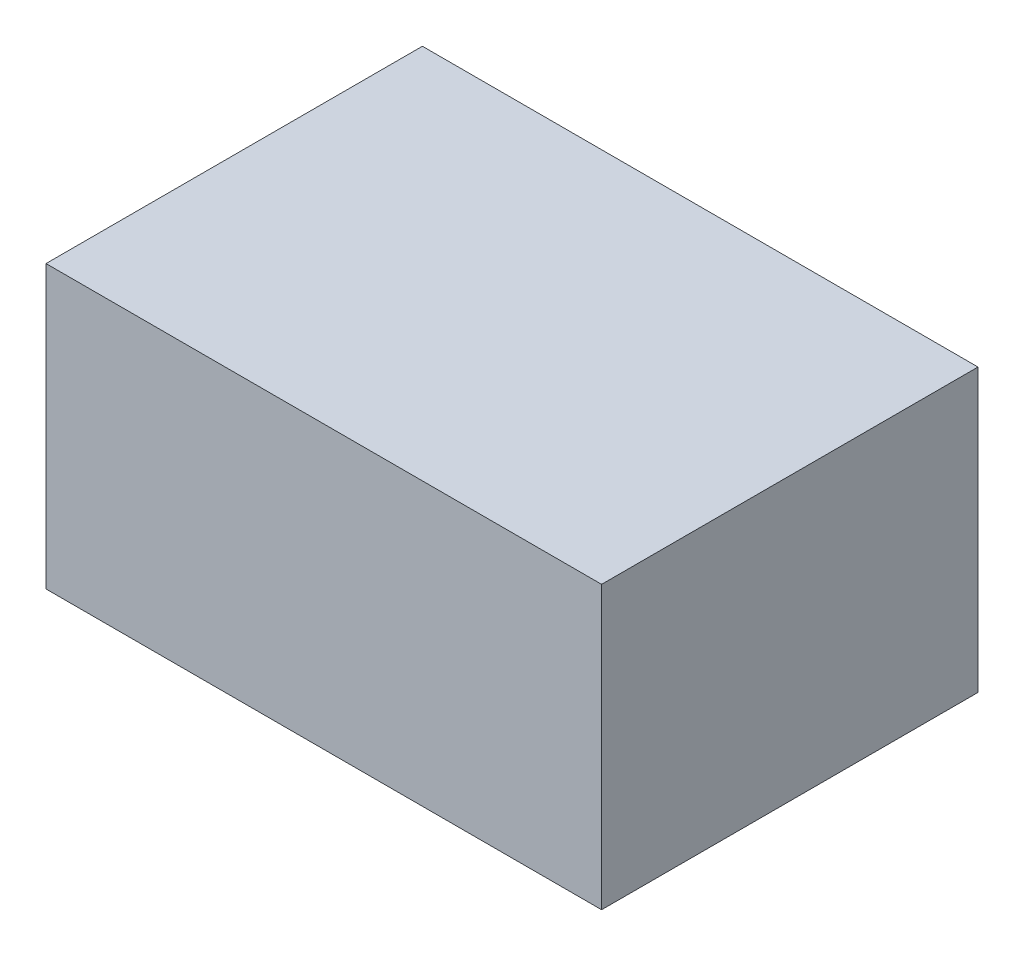
ISO-10303-21;
HEADER;
FILE_DESCRIPTION(('STEP AP214'),'2;1');
FILE_NAME('part.step','',(''),(''),'','','');
FILE_SCHEMA(('AUTOMOTIVE_DESIGN { 1 0 10303 214 1 1 1 1 }'));
ENDSEC;
DATA;
#1=APPLICATION_CONTEXT('core data for automotive mechanical design processes');
#2=APPLICATION_PROTOCOL_DEFINITION('international standard','automotive_design',2000,#1);
#3=PRODUCT_CONTEXT('',#1,'mechanical');
#4=PRODUCT('Part','Part','',(#3));
#5=PRODUCT_RELATED_PRODUCT_CATEGORY('part','',(#4));
#6=PRODUCT_DEFINITION_FORMATION('','',#4);
#7=PRODUCT_DEFINITION_CONTEXT('part definition',#1,'design');
#8=PRODUCT_DEFINITION('design','',#6,#7);
#9=PRODUCT_DEFINITION_SHAPE('','',#8);
#10=(LENGTH_UNIT() NAMED_UNIT(*) SI_UNIT(.MILLI.,.METRE.));
#11=(NAMED_UNIT(*) PLANE_ANGLE_UNIT() SI_UNIT($,.RADIAN.));
#12=(NAMED_UNIT(*) SI_UNIT($,.STERADIAN.) SOLID_ANGLE_UNIT());
#13=UNCERTAINTY_MEASURE_WITH_UNIT(LENGTH_MEASURE(1.E-05),#10,'distance_accuracy_value','');
#14=(GEOMETRIC_REPRESENTATION_CONTEXT(3) GLOBAL_UNCERTAINTY_ASSIGNED_CONTEXT((#13)) GLOBAL_UNIT_ASSIGNED_CONTEXT((#10,
#11,#12)) REPRESENTATION_CONTEXT('',''));
#15=CARTESIAN_POINT('',(0.,0.,0.));
#16=DIRECTION('',(0.,0.,1.));
#17=DIRECTION('',(1.,0.,0.));
#18=AXIS2_PLACEMENT_3D('',#15,#16,#17);
#19=CARTESIAN_POINT('',(39.4274796646799,20.,-26.7105473204105));
#20=DIRECTION('',(-1.,0.,0.));
#21=DIRECTION('',(0.,0.,1.));
#22=AXIS2_PLACEMENT_3D('',#19,#20,#21);
#23=PLANE('',#22);
#24=DIRECTION('',(0.,0.,-1.));
#25=VECTOR('',#24,1.);
#26=CARTESIAN_POINT('',(39.4274796646799,-20.,-26.7105473204105));
#27=LINE('',#26,#25);
#28=CARTESIAN_POINT('',(39.4274796646799,-20.,26.7105473204105));
#29=VERTEX_POINT('',#28);
#30=CARTESIAN_POINT('',(39.4274796646799,-20.,-26.7105473204105));
#31=VERTEX_POINT('',#30);
#32=EDGE_CURVE('E96',#29,#31,#27,.T.);
#33=ORIENTED_EDGE('',*,*,#32,.T.);
#34=DIRECTION('',(0.,-1.,0.));
#35=VECTOR('',#34,1.);
#36=CARTESIAN_POINT('',(39.4274796646799,20.,-26.7105473204105));
#37=LINE('',#36,#35);
#38=CARTESIAN_POINT('',(39.4274796646799,20.,-26.7105473204105));
#39=VERTEX_POINT('',#38);
#40=EDGE_CURVE('E11',#39,#31,#37,.T.);
#41=ORIENTED_EDGE('',*,*,#40,.F.);
#42=DIRECTION('',(0.,0.,-1.));
#43=VECTOR('',#42,1.);
#44=CARTESIAN_POINT('',(39.4274796646799,20.,-26.7105473204105));
#45=LINE('',#44,#43);
#46=CARTESIAN_POINT('',(39.4274796646799,20.,26.7105473204105));
#47=VERTEX_POINT('',#46);
#48=EDGE_CURVE('E84',#47,#39,#45,.T.);
#49=ORIENTED_EDGE('',*,*,#48,.F.);
#50=DIRECTION('',(0.,-1.,0.));
#51=VECTOR('',#50,1.);
#52=CARTESIAN_POINT('',(39.4274796646799,20.,26.7105473204105));
#53=LINE('',#52,#51);
#54=EDGE_CURVE('E92',#47,#29,#53,.T.);
#55=ORIENTED_EDGE('',*,*,#54,.T.);
#56=EDGE_LOOP('',(#33,#41,#49,#55));
#57=FACE_BOUND('',#56,.T.);
#58=ADVANCED_FACE('F33',(#57),#23,.F.);
#59=CARTESIAN_POINT('',(-39.4274796646799,20.,-26.7105473204105));
#60=DIRECTION('',(0.,0.,1.));
#61=DIRECTION('',(1.,0.,0.));
#62=AXIS2_PLACEMENT_3D('',#59,#60,#61);
#63=PLANE('',#62);
#64=DIRECTION('',(-1.,0.,0.));
#65=VECTOR('',#64,1.);
#66=CARTESIAN_POINT('',(-39.4274796646799,-20.,-26.7105473204105));
#67=LINE('',#66,#65);
#68=CARTESIAN_POINT('',(-39.4274796646799,-20.,-26.7105473204105));
#69=VERTEX_POINT('',#68);
#70=EDGE_CURVE('E88',#31,#69,#67,.T.);
#71=ORIENTED_EDGE('',*,*,#70,.T.);
#72=DIRECTION('',(0.,-1.,0.));
#73=VECTOR('',#72,1.);
#74=CARTESIAN_POINT('',(-39.4274796646799,20.,-26.7105473204105));
#75=LINE('',#74,#73);
#76=CARTESIAN_POINT('',(-39.4274796646799,20.,-26.7105473204105));
#77=VERTEX_POINT('',#76);
#78=EDGE_CURVE('E41',#77,#69,#75,.T.);
#79=ORIENTED_EDGE('',*,*,#78,.F.);
#80=DIRECTION('',(-1.,0.,0.));
#81=VECTOR('',#80,1.);
#82=CARTESIAN_POINT('',(-39.4274796646799,20.,-26.7105473204105));
#83=LINE('',#82,#81);
#84=EDGE_CURVE('E79',#39,#77,#83,.T.);
#85=ORIENTED_EDGE('',*,*,#84,.F.);
#86=ORIENTED_EDGE('',*,*,#40,.T.);
#87=EDGE_LOOP('',(#71,#79,#85,#86));
#88=FACE_BOUND('',#87,.T.);
#89=ADVANCED_FACE('F87',(#88),#63,.F.);
#90=CARTESIAN_POINT('',(-39.4274796646799,20.,-26.7105473204105));
#91=DIRECTION('',(1.,0.,0.));
#92=DIRECTION('',(0.,0.,-1.));
#93=AXIS2_PLACEMENT_3D('',#90,#91,#92);
#94=PLANE('',#93);
#95=DIRECTION('',(0.,0.,1.));
#96=VECTOR('',#95,1.);
#97=CARTESIAN_POINT('',(-39.4274796646799,-20.,-26.7105473204105));
#98=LINE('',#97,#96);
#99=CARTESIAN_POINT('',(-39.4274796646799,-20.,26.7105473204105));
#100=VERTEX_POINT('',#99);
#101=EDGE_CURVE('E66',#69,#100,#98,.T.);
#102=ORIENTED_EDGE('',*,*,#101,.T.);
#103=DIRECTION('',(0.,-1.,0.));
#104=VECTOR('',#103,1.);
#105=CARTESIAN_POINT('',(-39.4274796646799,20.,26.7105473204105));
#106=LINE('',#105,#104);
#107=CARTESIAN_POINT('',(-39.4274796646799,20.,26.7105473204105));
#108=VERTEX_POINT('',#107);
#109=EDGE_CURVE('E89',#108,#100,#106,.T.);
#110=ORIENTED_EDGE('',*,*,#109,.F.);
#111=DIRECTION('',(0.,0.,1.));
#112=VECTOR('',#111,1.);
#113=CARTESIAN_POINT('',(-39.4274796646799,20.,-26.7105473204105));
#114=LINE('',#113,#112);
#115=EDGE_CURVE('E82',#77,#108,#114,.T.);
#116=ORIENTED_EDGE('',*,*,#115,.F.);
#117=ORIENTED_EDGE('',*,*,#78,.T.);
#118=EDGE_LOOP('',(#102,#110,#116,#117));
#119=FACE_BOUND('',#118,.T.);
#120=ADVANCED_FACE('F90',(#119),#94,.F.);
#121=CARTESIAN_POINT('',(-39.4274796646799,20.,26.7105473204105));
#122=DIRECTION('',(0.,0.,-1.));
#123=DIRECTION('',(-1.,0.,0.));
#124=AXIS2_PLACEMENT_3D('',#121,#122,#123);
#125=PLANE('',#124);
#126=DIRECTION('',(1.,0.,0.));
#127=VECTOR('',#126,1.);
#128=CARTESIAN_POINT('',(-39.4274796646799,-20.,26.7105473204105));
#129=LINE('',#128,#127);
#130=EDGE_CURVE('E72',#100,#29,#129,.T.);
#131=ORIENTED_EDGE('',*,*,#130,.T.);
#132=ORIENTED_EDGE('',*,*,#54,.F.);
#133=DIRECTION('',(1.,0.,0.));
#134=VECTOR('',#133,1.);
#135=CARTESIAN_POINT('',(-39.4274796646799,20.,26.7105473204105));
#136=LINE('',#135,#134);
#137=EDGE_CURVE('E49',#108,#47,#136,.T.);
#138=ORIENTED_EDGE('',*,*,#137,.F.);
#139=ORIENTED_EDGE('',*,*,#109,.T.);
#140=EDGE_LOOP('',(#131,#132,#138,#139));
#141=FACE_BOUND('',#140,.T.);
#142=ADVANCED_FACE('F103',(#141),#125,.F.);
#143=CARTESIAN_POINT('',(0.,20.,0.));
#144=DIRECTION('',(0.,1.,0.));
#145=DIRECTION('',(0.,0.,1.));
#146=AXIS2_PLACEMENT_3D('',#143,#144,#145);
#147=PLANE('',#146);
#148=ORIENTED_EDGE('',*,*,#48,.T.);
#149=ORIENTED_EDGE('',*,*,#84,.T.);
#150=ORIENTED_EDGE('',*,*,#115,.T.);
#151=ORIENTED_EDGE('',*,*,#137,.T.);
#152=EDGE_LOOP('',(#148,#149,#150,#151));
#153=FACE_BOUND('',#152,.T.);
#154=ADVANCED_FACE('F80',(#153),#147,.T.);
#155=CARTESIAN_POINT('',(0.,-20.,0.));
#156=DIRECTION('',(0.,1.,0.));
#157=DIRECTION('',(0.,0.,1.));
#158=AXIS2_PLACEMENT_3D('',#155,#156,#157);
#159=PLANE('',#158);
#160=ORIENTED_EDGE('',*,*,#32,.F.);
#161=ORIENTED_EDGE('',*,*,#130,.F.);
#162=ORIENTED_EDGE('',*,*,#101,.F.);
#163=ORIENTED_EDGE('',*,*,#70,.F.);
#164=EDGE_LOOP('',(#160,#161,#162,#163));
#165=FACE_BOUND('',#164,.T.);
#166=ADVANCED_FACE('F106',(#165),#159,.F.);
#167=CLOSED_SHELL('',(#58,#89,#120,#142,#154,#166));
#168=MANIFOLD_SOLID_BREP('B2',#167);
#169=ADVANCED_BREP_SHAPE_REPRESENTATION('',(#18,#168),#14);
#170=SHAPE_DEFINITION_REPRESENTATION(#9,#169);
ENDSEC;
END-ISO-10303-21;
